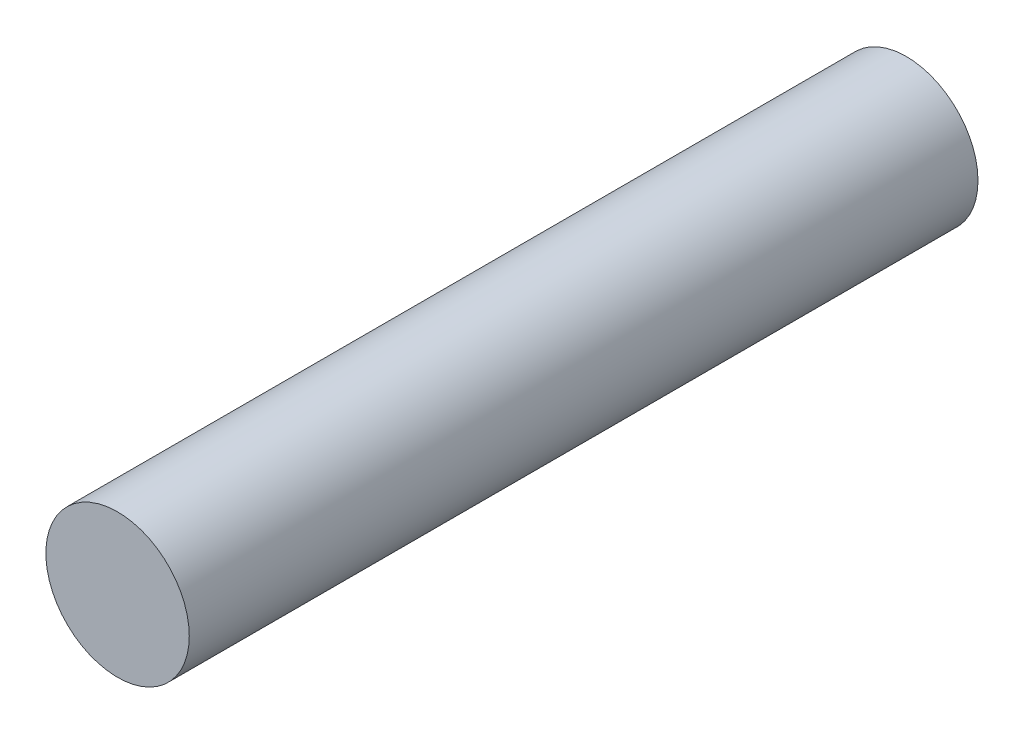
ISO-10303-21;
HEADER;
FILE_DESCRIPTION(('STEP AP214'),'2;1');
FILE_NAME('part.step','',(''),(''),'','','');
FILE_SCHEMA(('AUTOMOTIVE_DESIGN { 1 0 10303 214 1 1 1 1 }'));
ENDSEC;
DATA;
#1=APPLICATION_CONTEXT('core data for automotive mechanical design processes');
#2=APPLICATION_PROTOCOL_DEFINITION('international standard','automotive_design',2000,#1);
#3=PRODUCT_CONTEXT('',#1,'mechanical');
#4=PRODUCT('Part','Part','',(#3));
#5=PRODUCT_RELATED_PRODUCT_CATEGORY('part','',(#4));
#6=PRODUCT_DEFINITION_FORMATION('','',#4);
#7=PRODUCT_DEFINITION_CONTEXT('part definition',#1,'design');
#8=PRODUCT_DEFINITION('design','',#6,#7);
#9=PRODUCT_DEFINITION_SHAPE('','',#8);
#10=(LENGTH_UNIT() NAMED_UNIT(*) SI_UNIT(.MILLI.,.METRE.));
#11=(NAMED_UNIT(*) PLANE_ANGLE_UNIT() SI_UNIT($,.RADIAN.));
#12=(NAMED_UNIT(*) SI_UNIT($,.STERADIAN.) SOLID_ANGLE_UNIT());
#13=UNCERTAINTY_MEASURE_WITH_UNIT(LENGTH_MEASURE(1.E-05),#10,'distance_accuracy_value','');
#14=(GEOMETRIC_REPRESENTATION_CONTEXT(3) GLOBAL_UNCERTAINTY_ASSIGNED_CONTEXT((#13)) GLOBAL_UNIT_ASSIGNED_CONTEXT((#10,
#11,#12)) REPRESENTATION_CONTEXT('',''));
#15=CARTESIAN_POINT('',(0.,0.,0.));
#16=DIRECTION('',(0.,0.,1.));
#17=DIRECTION('',(1.,0.,0.));
#18=AXIS2_PLACEMENT_3D('',#15,#16,#17);
#19=CARTESIAN_POINT('',(0.,0.,2.75));
#20=DIRECTION('',(0.,0.,-1.));
#21=DIRECTION('',(-1.,0.,0.));
#22=AXIS2_PLACEMENT_3D('',#19,#20,#21);
#23=CYLINDRICAL_SURFACE('',#22,0.25);
#24=CARTESIAN_POINT('',(0.,0.,2.75));
#25=DIRECTION('',(0.,0.,1.));
#26=DIRECTION('',(1.,0.,0.));
#27=AXIS2_PLACEMENT_3D('',#24,#25,#26);
#28=CIRCLE('',#27,0.25);
#29=CARTESIAN_POINT('',(0.25,0.,2.75));
#30=VERTEX_POINT('',#29);
#31=EDGE_CURVE('E10',#30,#30,#28,.T.);
#32=ORIENTED_EDGE('',*,*,#31,.F.);
#33=EDGE_LOOP('',(#32));
#34=FACE_BOUND('',#33,.T.);
#35=CARTESIAN_POINT('',(0.,0.,0.));
#36=DIRECTION('',(0.,0.,1.));
#37=DIRECTION('',(1.,0.,0.));
#38=AXIS2_PLACEMENT_3D('',#35,#36,#37);
#39=CIRCLE('',#38,0.25);
#40=CARTESIAN_POINT('',(0.25,0.,0.));
#41=VERTEX_POINT('',#40);
#42=EDGE_CURVE('E35',#41,#41,#39,.T.);
#43=ORIENTED_EDGE('',*,*,#42,.T.);
#44=EDGE_LOOP('',(#43));
#45=FACE_BOUND('',#44,.T.);
#46=ADVANCED_FACE('F32',(#34,#45),#23,.T.);
#47=CARTESIAN_POINT('',(0.,0.,2.75));
#48=DIRECTION('',(0.,0.,1.));
#49=DIRECTION('',(1.,0.,0.));
#50=AXIS2_PLACEMENT_3D('',#47,#48,#49);
#51=PLANE('',#50);
#52=ORIENTED_EDGE('',*,*,#31,.T.);
#53=EDGE_LOOP('',(#52));
#54=FACE_BOUND('',#53,.T.);
#55=ADVANCED_FACE('F47',(#54),#51,.T.);
#56=CARTESIAN_POINT('',(0.,0.,0.));
#57=DIRECTION('',(0.,0.,1.));
#58=DIRECTION('',(1.,0.,0.));
#59=AXIS2_PLACEMENT_3D('',#56,#57,#58);
#60=PLANE('',#59);
#61=ORIENTED_EDGE('',*,*,#42,.F.);
#62=EDGE_LOOP('',(#61));
#63=FACE_BOUND('',#62,.T.);
#64=ADVANCED_FACE('F45',(#63),#60,.F.);
#65=CLOSED_SHELL('',(#46,#55,#64));
#66=MANIFOLD_SOLID_BREP('B2',#65);
#67=ADVANCED_BREP_SHAPE_REPRESENTATION('',(#18,#66),#14);
#68=SHAPE_DEFINITION_REPRESENTATION(#9,#67);
ENDSEC;
END-ISO-10303-21;
